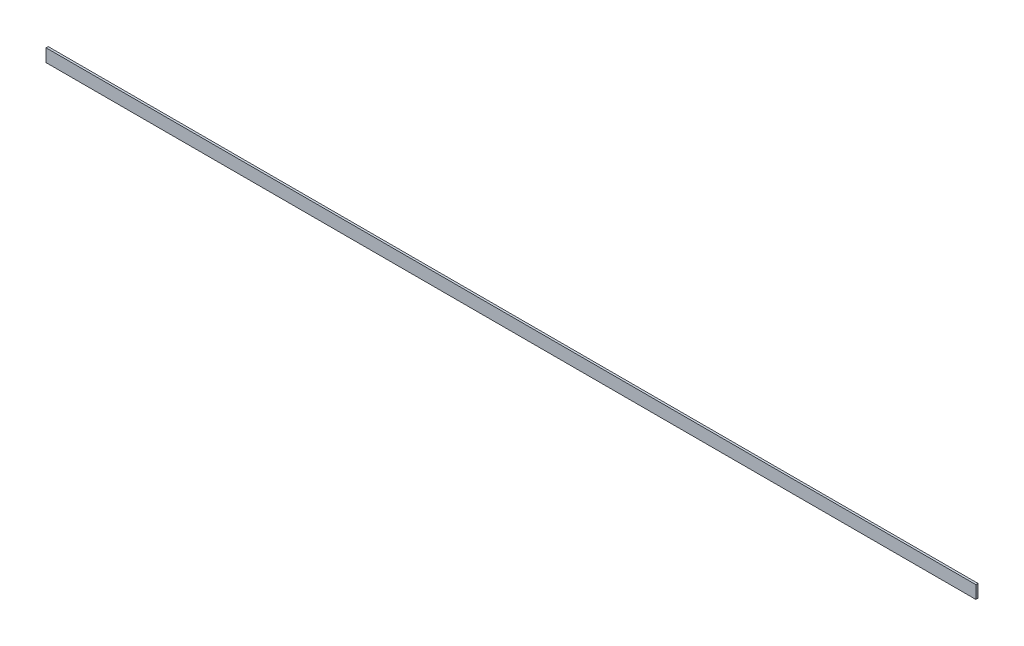
ISO-10303-21;
HEADER;
FILE_DESCRIPTION(('STEP AP214'),'2;1');
FILE_NAME('part.step','',(''),(''),'','','');
FILE_SCHEMA(('AUTOMOTIVE_DESIGN { 1 0 10303 214 1 1 1 1 }'));
ENDSEC;
DATA;
#1=APPLICATION_CONTEXT('core data for automotive mechanical design processes');
#2=APPLICATION_PROTOCOL_DEFINITION('international standard','automotive_design',2000,#1);
#3=PRODUCT_CONTEXT('',#1,'mechanical');
#4=PRODUCT('Part','Part','',(#3));
#5=PRODUCT_RELATED_PRODUCT_CATEGORY('part','',(#4));
#6=PRODUCT_DEFINITION_FORMATION('','',#4);
#7=PRODUCT_DEFINITION_CONTEXT('part definition',#1,'design');
#8=PRODUCT_DEFINITION('design','',#6,#7);
#9=PRODUCT_DEFINITION_SHAPE('','',#8);
#10=(LENGTH_UNIT() NAMED_UNIT(*) SI_UNIT(.MILLI.,.METRE.));
#11=(NAMED_UNIT(*) PLANE_ANGLE_UNIT() SI_UNIT($,.RADIAN.));
#12=(NAMED_UNIT(*) SI_UNIT($,.STERADIAN.) SOLID_ANGLE_UNIT());
#13=UNCERTAINTY_MEASURE_WITH_UNIT(LENGTH_MEASURE(1.E-05),#10,'distance_accuracy_value','');
#14=(GEOMETRIC_REPRESENTATION_CONTEXT(3) GLOBAL_UNCERTAINTY_ASSIGNED_CONTEXT((#13)) GLOBAL_UNIT_ASSIGNED_CONTEXT((#10,
#11,#12)) REPRESENTATION_CONTEXT('',''));
#15=CARTESIAN_POINT('',(0.,0.,0.));
#16=DIRECTION('',(0.,0.,1.));
#17=DIRECTION('',(1.,0.,0.));
#18=AXIS2_PLACEMENT_3D('',#15,#16,#17);
#19=CARTESIAN_POINT('',(2170.,0.,0.));
#20=DIRECTION('',(0.,0.,-1.));
#21=DIRECTION('',(-1.,0.,0.));
#22=AXIS2_PLACEMENT_3D('',#19,#20,#21);
#23=PLANE('',#22);
#24=DIRECTION('',(0.,-1.,0.));
#25=VECTOR('',#24,1.);
#26=CARTESIAN_POINT('',(0.,0.,0.));
#27=LINE('',#26,#25);
#28=CARTESIAN_POINT('',(0.,30.,0.));
#29=VERTEX_POINT('',#28);
#30=CARTESIAN_POINT('',(0.,0.,0.));
#31=VERTEX_POINT('',#30);
#32=EDGE_CURVE('E107',#29,#31,#27,.T.);
#33=ORIENTED_EDGE('',*,*,#32,.T.);
#34=DIRECTION('',(-1.,0.,0.));
#35=VECTOR('',#34,1.);
#36=CARTESIAN_POINT('',(2170.,0.,0.));
#37=LINE('',#36,#35);
#38=CARTESIAN_POINT('',(2170.,0.,0.));
#39=VERTEX_POINT('',#38);
#40=EDGE_CURVE('E11',#39,#31,#37,.T.);
#41=ORIENTED_EDGE('',*,*,#40,.F.);
#42=DIRECTION('',(0.,-1.,0.));
#43=VECTOR('',#42,1.);
#44=CARTESIAN_POINT('',(2170.,0.,0.));
#45=LINE('',#44,#43);
#46=CARTESIAN_POINT('',(2170.,30.,0.));
#47=VERTEX_POINT('',#46);
#48=EDGE_CURVE('E91',#47,#39,#45,.T.);
#49=ORIENTED_EDGE('',*,*,#48,.F.);
#50=DIRECTION('',(-1.,0.,0.));
#51=VECTOR('',#50,1.);
#52=CARTESIAN_POINT('',(2170.,30.,0.));
#53=LINE('',#52,#51);
#54=EDGE_CURVE('E103',#47,#29,#53,.T.);
#55=ORIENTED_EDGE('',*,*,#54,.T.);
#56=EDGE_LOOP('',(#33,#41,#49,#55));
#57=FACE_BOUND('',#56,.T.);
#58=ADVANCED_FACE('F39',(#57),#23,.F.);
#59=CARTESIAN_POINT('',(2170.,0.,0.));
#60=DIRECTION('',(0.,1.,0.));
#61=DIRECTION('',(0.,0.,1.));
#62=AXIS2_PLACEMENT_3D('',#59,#60,#61);
#63=PLANE('',#62);
#64=DIRECTION('',(0.,0.,-1.));
#65=VECTOR('',#64,1.);
#66=CARTESIAN_POINT('',(0.,0.,0.));
#67=LINE('',#66,#65);
#68=CARTESIAN_POINT('',(0.,0.,-5.));
#69=VERTEX_POINT('',#68);
#70=EDGE_CURVE('E96',#31,#69,#67,.T.);
#71=ORIENTED_EDGE('',*,*,#70,.T.);
#72=DIRECTION('',(-1.,0.,0.));
#73=VECTOR('',#72,1.);
#74=CARTESIAN_POINT('',(2170.,0.,-5.));
#75=LINE('',#74,#73);
#76=CARTESIAN_POINT('',(2170.,0.,-5.));
#77=VERTEX_POINT('',#76);
#78=EDGE_CURVE('E48',#77,#69,#75,.T.);
#79=ORIENTED_EDGE('',*,*,#78,.F.);
#80=DIRECTION('',(0.,0.,-1.));
#81=VECTOR('',#80,1.);
#82=CARTESIAN_POINT('',(2170.,0.,0.));
#83=LINE('',#82,#81);
#84=EDGE_CURVE('E86',#39,#77,#83,.T.);
#85=ORIENTED_EDGE('',*,*,#84,.F.);
#86=ORIENTED_EDGE('',*,*,#40,.T.);
#87=EDGE_LOOP('',(#71,#79,#85,#86));
#88=FACE_BOUND('',#87,.T.);
#89=ADVANCED_FACE('F95',(#88),#63,.F.);
#90=CARTESIAN_POINT('',(2170.,0.,-5.));
#91=DIRECTION('',(0.,0.,1.));
#92=DIRECTION('',(1.,0.,0.));
#93=AXIS2_PLACEMENT_3D('',#90,#91,#92);
#94=PLANE('',#93);
#95=DIRECTION('',(0.,1.,0.));
#96=VECTOR('',#95,1.);
#97=CARTESIAN_POINT('',(0.,0.,-5.));
#98=LINE('',#97,#96);
#99=CARTESIAN_POINT('',(0.,30.,-5.));
#100=VERTEX_POINT('',#99);
#101=EDGE_CURVE('E73',#69,#100,#98,.T.);
#102=ORIENTED_EDGE('',*,*,#101,.T.);
#103=DIRECTION('',(-1.,0.,0.));
#104=VECTOR('',#103,1.);
#105=CARTESIAN_POINT('',(2170.,30.,-5.));
#106=LINE('',#105,#104);
#107=CARTESIAN_POINT('',(2170.,30.,-5.));
#108=VERTEX_POINT('',#107);
#109=EDGE_CURVE('E98',#108,#100,#106,.T.);
#110=ORIENTED_EDGE('',*,*,#109,.F.);
#111=DIRECTION('',(0.,1.,0.));
#112=VECTOR('',#111,1.);
#113=CARTESIAN_POINT('',(2170.,0.,-5.));
#114=LINE('',#113,#112);
#115=EDGE_CURVE('E89',#77,#108,#114,.T.);
#116=ORIENTED_EDGE('',*,*,#115,.F.);
#117=ORIENTED_EDGE('',*,*,#78,.T.);
#118=EDGE_LOOP('',(#102,#110,#116,#117));
#119=FACE_BOUND('',#118,.T.);
#120=ADVANCED_FACE('F99',(#119),#94,.F.);
#121=CARTESIAN_POINT('',(2170.,30.,0.));
#122=DIRECTION('',(0.,-1.,0.));
#123=DIRECTION('',(0.,0.,-1.));
#124=AXIS2_PLACEMENT_3D('',#121,#122,#123);
#125=PLANE('',#124);
#126=DIRECTION('',(0.,0.,1.));
#127=VECTOR('',#126,1.);
#128=CARTESIAN_POINT('',(0.,30.,0.));
#129=LINE('',#128,#127);
#130=EDGE_CURVE('E79',#100,#29,#129,.T.);
#131=ORIENTED_EDGE('',*,*,#130,.T.);
#132=ORIENTED_EDGE('',*,*,#54,.F.);
#133=DIRECTION('',(0.,0.,1.));
#134=VECTOR('',#133,1.);
#135=CARTESIAN_POINT('',(2170.,30.,0.));
#136=LINE('',#135,#134);
#137=EDGE_CURVE('E56',#108,#47,#136,.T.);
#138=ORIENTED_EDGE('',*,*,#137,.F.);
#139=ORIENTED_EDGE('',*,*,#109,.T.);
#140=EDGE_LOOP('',(#131,#132,#138,#139));
#141=FACE_BOUND('',#140,.T.);
#142=ADVANCED_FACE('F120',(#141),#125,.F.);
#143=CARTESIAN_POINT('',(2170.,0.,0.));
#144=DIRECTION('',(-1.,0.,0.));
#145=DIRECTION('',(0.,0.,1.));
#146=AXIS2_PLACEMENT_3D('',#143,#144,#145);
#147=PLANE('',#146);
#148=ORIENTED_EDGE('',*,*,#48,.T.);
#149=ORIENTED_EDGE('',*,*,#84,.T.);
#150=ORIENTED_EDGE('',*,*,#115,.T.);
#151=ORIENTED_EDGE('',*,*,#137,.T.);
#152=EDGE_LOOP('',(#148,#149,#150,#151));
#153=FACE_BOUND('',#152,.T.);
#154=ADVANCED_FACE('F87',(#153),#147,.F.);
#155=CARTESIAN_POINT('',(0.,0.,0.));
#156=DIRECTION('',(-1.,0.,0.));
#157=DIRECTION('',(0.,0.,1.));
#158=AXIS2_PLACEMENT_3D('',#155,#156,#157);
#159=PLANE('',#158);
#160=ORIENTED_EDGE('',*,*,#32,.F.);
#161=ORIENTED_EDGE('',*,*,#130,.F.);
#162=ORIENTED_EDGE('',*,*,#101,.F.);
#163=ORIENTED_EDGE('',*,*,#70,.F.);
#164=EDGE_LOOP('',(#160,#161,#162,#163));
#165=FACE_BOUND('',#164,.T.);
#166=ADVANCED_FACE('F123',(#165),#159,.T.);
#167=CLOSED_SHELL('',(#58,#89,#120,#142,#154,#166));
#168=MANIFOLD_SOLID_BREP('B2',#167);
#169=ADVANCED_BREP_SHAPE_REPRESENTATION('',(#18,#168),#14);
#170=SHAPE_DEFINITION_REPRESENTATION(#9,#169);
ENDSEC;
END-ISO-10303-21;
